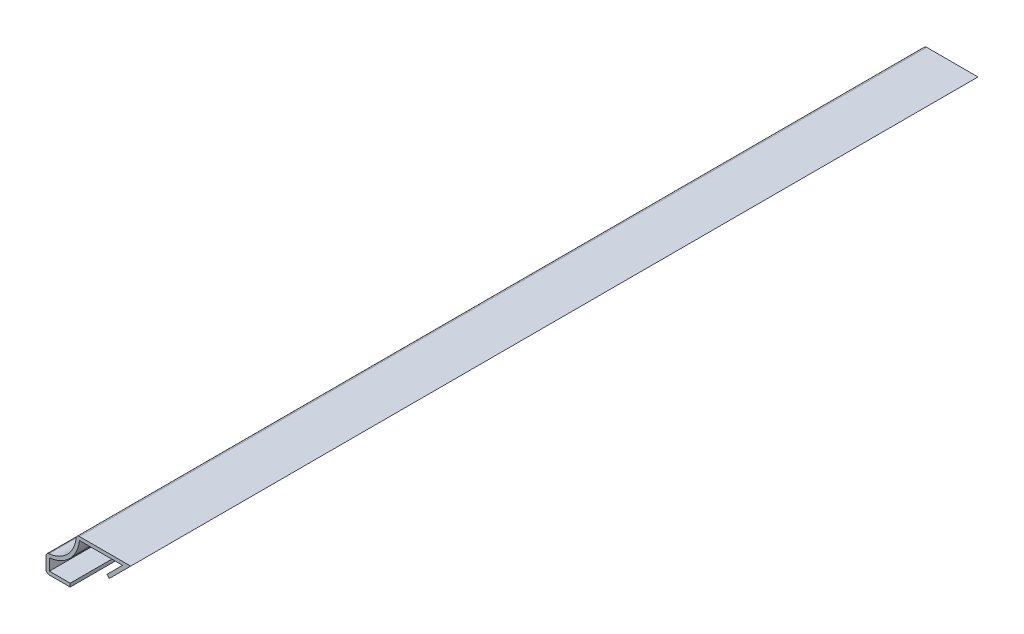
ISO-10303-21;
HEADER;
FILE_DESCRIPTION(('STEP AP214'),'2;1');
FILE_NAME('part.step','',(''),(''),'','','');
FILE_SCHEMA(('AUTOMOTIVE_DESIGN { 1 0 10303 214 1 1 1 1 }'));
ENDSEC;
DATA;
#1=APPLICATION_CONTEXT('core data for automotive mechanical design processes');
#2=APPLICATION_PROTOCOL_DEFINITION('international standard','automotive_design',2000,#1);
#3=PRODUCT_CONTEXT('',#1,'mechanical');
#4=PRODUCT('Part','Part','',(#3));
#5=PRODUCT_RELATED_PRODUCT_CATEGORY('part','',(#4));
#6=PRODUCT_DEFINITION_FORMATION('','',#4);
#7=PRODUCT_DEFINITION_CONTEXT('part definition',#1,'design');
#8=PRODUCT_DEFINITION('design','',#6,#7);
#9=PRODUCT_DEFINITION_SHAPE('','',#8);
#10=(LENGTH_UNIT() NAMED_UNIT(*) SI_UNIT(.MILLI.,.METRE.));
#11=(NAMED_UNIT(*) PLANE_ANGLE_UNIT() SI_UNIT($,.RADIAN.));
#12=(NAMED_UNIT(*) SI_UNIT($,.STERADIAN.) SOLID_ANGLE_UNIT());
#13=UNCERTAINTY_MEASURE_WITH_UNIT(LENGTH_MEASURE(1.E-05),#10,'distance_accuracy_value','');
#14=(GEOMETRIC_REPRESENTATION_CONTEXT(3) GLOBAL_UNCERTAINTY_ASSIGNED_CONTEXT((#13)) GLOBAL_UNIT_ASSIGNED_CONTEXT((#10,
#11,#12)) REPRESENTATION_CONTEXT('',''));
#15=CARTESIAN_POINT('',(0.,0.,0.));
#16=DIRECTION('',(0.,0.,1.));
#17=DIRECTION('',(1.,0.,0.));
#18=AXIS2_PLACEMENT_3D('',#15,#16,#17);
#19=CARTESIAN_POINT('',(15.2463820715252,13.3286179284748,-222.25));
#20=DIRECTION('',(-0.707106781186547,0.707106781186548,0.));
#21=DIRECTION('',(-0.707106781186548,-0.707106781186547,0.));
#22=AXIS2_PLACEMENT_3D('',#19,#20,#21);
#23=PLANE('',#22);
#24=DIRECTION('',(-0.707106781186548,-0.707106781186547,0.));
#25=VECTOR('',#24,1.);
#26=CARTESIAN_POINT('',(15.2463820715252,13.3286179284748,0.));
#27=LINE('',#26,#25);
#28=CARTESIAN_POINT('',(13.7287641430503,11.811,0.));
#29=VERTEX_POINT('',#28);
#30=CARTESIAN_POINT('',(9.63372199585694,7.71595785280662,0.));
#31=VERTEX_POINT('',#30);
#32=EDGE_CURVE('E196',#29,#31,#27,.T.);
#33=ORIENTED_EDGE('',*,*,#32,.F.);
#34=DIRECTION('',(0.,0.,1.));
#35=VECTOR('',#34,1.);
#36=CARTESIAN_POINT('',(13.7287641430503,11.811,-222.25));
#37=LINE('',#36,#35);
#38=CARTESIAN_POINT('',(13.7287641430503,11.811,-222.25));
#39=VERTEX_POINT('',#38);
#40=EDGE_CURVE('E168',#39,#29,#37,.T.);
#41=ORIENTED_EDGE('',*,*,#40,.F.);
#42=DIRECTION('',(-0.707106781186548,-0.707106781186547,0.));
#43=VECTOR('',#42,1.);
#44=CARTESIAN_POINT('',(15.2463820715252,13.3286179284748,-222.25));
#45=LINE('',#44,#43);
#46=CARTESIAN_POINT('',(9.63372199585694,7.71595785280662,-222.25));
#47=VERTEX_POINT('',#46);
#48=EDGE_CURVE('E149',#39,#47,#45,.T.);
#49=ORIENTED_EDGE('',*,*,#48,.T.);
#50=DIRECTION('',(0.,0.,1.));
#51=VECTOR('',#50,1.);
#52=CARTESIAN_POINT('',(9.63372199585694,7.71595785280662,-222.25));
#53=LINE('',#52,#51);
#54=EDGE_CURVE('E158',#47,#31,#53,.T.);
#55=ORIENTED_EDGE('',*,*,#54,.T.);
#56=EDGE_LOOP('',(#33,#41,#49,#55));
#57=FACE_BOUND('',#56,.T.);
#58=ADVANCED_FACE('F35',(#57),#23,.T.);
#59=CARTESIAN_POINT('',(1.5875,11.811,-222.25));
#60=DIRECTION('',(0.,-1.,0.));
#61=DIRECTION('',(0.,0.,-1.));
#62=AXIS2_PLACEMENT_3D('',#59,#60,#61);
#63=PLANE('',#62);
#64=DIRECTION('',(1.,0.,0.));
#65=VECTOR('',#64,1.);
#66=CARTESIAN_POINT('',(1.5875,11.811,0.));
#67=LINE('',#66,#65);
#68=CARTESIAN_POINT('',(2.43161609557148,11.811,0.));
#69=VERTEX_POINT('',#68);
#70=EDGE_CURVE('E169',#69,#29,#67,.T.);
#71=ORIENTED_EDGE('',*,*,#70,.F.);
#72=DIRECTION('',(0.,0.,1.));
#73=VECTOR('',#72,1.);
#74=CARTESIAN_POINT('',(2.43161609557148,11.811,-222.25));
#75=LINE('',#74,#73);
#76=CARTESIAN_POINT('',(2.43161609557148,11.811,-222.25));
#77=VERTEX_POINT('',#76);
#78=EDGE_CURVE('E223',#77,#69,#75,.T.);
#79=ORIENTED_EDGE('',*,*,#78,.F.);
#80=DIRECTION('',(1.,0.,0.));
#81=VECTOR('',#80,1.);
#82=CARTESIAN_POINT('',(1.5875,11.811,-222.25));
#83=LINE('',#82,#81);
#84=EDGE_CURVE('E166',#77,#39,#83,.T.);
#85=ORIENTED_EDGE('',*,*,#84,.T.);
#86=ORIENTED_EDGE('',*,*,#40,.T.);
#87=EDGE_LOOP('',(#71,#79,#85,#86));
#88=FACE_BOUND('',#87,.T.);
#89=ADVANCED_FACE('F296',(#88),#63,.T.);
#90=CARTESIAN_POINT('',(-6.35,12.7,-222.25));
#91=DIRECTION('',(0.,0.,1.));
#92=DIRECTION('',(1.,0.,0.));
#93=AXIS2_PLACEMENT_3D('',#90,#91,#92);
#94=CYLINDRICAL_SURFACE('',#93,8.8265);
#95=CARTESIAN_POINT('',(-6.35,12.7,0.));
#96=DIRECTION('',(0.,0.,1.));
#97=DIRECTION('',(1.,0.,0.));
#98=AXIS2_PLACEMENT_3D('',#95,#96,#97);
#99=CIRCLE('',#98,8.8265);
#100=CARTESIAN_POINT('',(-5.461,3.91838390442852,0.));
#101=VERTEX_POINT('',#100);
#102=EDGE_CURVE('E172',#101,#69,#99,.T.);
#103=ORIENTED_EDGE('',*,*,#102,.F.);
#104=DIRECTION('',(0.,0.,1.));
#105=VECTOR('',#104,1.);
#106=CARTESIAN_POINT('',(-5.461,3.91838390442852,-222.25));
#107=LINE('',#106,#105);
#108=CARTESIAN_POINT('',(-5.461,3.91838390442852,-222.25));
#109=VERTEX_POINT('',#108);
#110=EDGE_CURVE('E225',#109,#101,#107,.T.);
#111=ORIENTED_EDGE('',*,*,#110,.F.);
#112=CARTESIAN_POINT('',(-6.35,12.7,-222.25));
#113=DIRECTION('',(0.,0.,1.));
#114=DIRECTION('',(1.,0.,0.));
#115=AXIS2_PLACEMENT_3D('',#112,#113,#114);
#116=CIRCLE('',#115,8.8265);
#117=EDGE_CURVE('E192',#109,#77,#116,.T.);
#118=ORIENTED_EDGE('',*,*,#117,.T.);
#119=ORIENTED_EDGE('',*,*,#78,.T.);
#120=EDGE_LOOP('',(#103,#111,#118,#119));
#121=FACE_BOUND('',#120,.T.);
#122=ADVANCED_FACE('F315',(#121),#94,.T.);
#123=CARTESIAN_POINT('',(-5.461,0.,-222.25));
#124=DIRECTION('',(1.,0.,0.));
#125=DIRECTION('',(0.,0.,-1.));
#126=AXIS2_PLACEMENT_3D('',#123,#124,#125);
#127=PLANE('',#126);
#128=DIRECTION('',(0.,1.,0.));
#129=VECTOR('',#128,1.);
#130=CARTESIAN_POINT('',(-5.461,0.,0.));
#131=LINE('',#130,#129);
#132=CARTESIAN_POINT('',(-5.461,0.888999999999999,0.));
#133=VERTEX_POINT('',#132);
#134=EDGE_CURVE('E216',#133,#101,#131,.T.);
#135=ORIENTED_EDGE('',*,*,#134,.F.);
#136=DIRECTION('',(0.,0.,1.));
#137=VECTOR('',#136,1.);
#138=CARTESIAN_POINT('',(-5.461,0.888999999999999,-222.25));
#139=LINE('',#138,#137);
#140=CARTESIAN_POINT('',(-5.461,0.888999999999999,-222.25));
#141=VERTEX_POINT('',#140);
#142=EDGE_CURVE('E227',#141,#133,#139,.T.);
#143=ORIENTED_EDGE('',*,*,#142,.F.);
#144=DIRECTION('',(0.,1.,0.));
#145=VECTOR('',#144,1.);
#146=CARTESIAN_POINT('',(-5.461,0.,-222.25));
#147=LINE('',#146,#145);
#148=EDGE_CURVE('E189',#141,#109,#147,.T.);
#149=ORIENTED_EDGE('',*,*,#148,.T.);
#150=ORIENTED_EDGE('',*,*,#110,.T.);
#151=EDGE_LOOP('',(#135,#143,#149,#150));
#152=FACE_BOUND('',#151,.T.);
#153=ADVANCED_FACE('F291',(#152),#127,.T.);
#154=CARTESIAN_POINT('',(0.,0.889,-222.25));
#155=DIRECTION('',(0.,1.,0.));
#156=DIRECTION('',(-1.,0.,0.));
#157=AXIS2_PLACEMENT_3D('',#154,#155,#156);
#158=PLANE('',#157);
#159=DIRECTION('',(-1.,0.,0.));
#160=VECTOR('',#159,1.);
#161=CARTESIAN_POINT('',(0.,0.889,0.));
#162=LINE('',#161,#160);
#163=CARTESIAN_POINT('',(0.,0.889,0.));
#164=VERTEX_POINT('',#163);
#165=EDGE_CURVE('E213',#164,#133,#162,.T.);
#166=ORIENTED_EDGE('',*,*,#165,.F.);
#167=DIRECTION('',(0.,0.,1.));
#168=VECTOR('',#167,1.);
#169=CARTESIAN_POINT('',(0.,0.889,-222.25));
#170=LINE('',#169,#168);
#171=CARTESIAN_POINT('',(0.,0.889,-222.25));
#172=VERTEX_POINT('',#171);
#173=EDGE_CURVE('E229',#172,#164,#170,.T.);
#174=ORIENTED_EDGE('',*,*,#173,.F.);
#175=DIRECTION('',(-1.,0.,0.));
#176=VECTOR('',#175,1.);
#177=CARTESIAN_POINT('',(0.,0.889,-222.25));
#178=LINE('',#177,#176);
#179=EDGE_CURVE('E186',#172,#141,#178,.T.);
#180=ORIENTED_EDGE('',*,*,#179,.T.);
#181=ORIENTED_EDGE('',*,*,#142,.T.);
#182=EDGE_LOOP('',(#166,#174,#180,#181));
#183=FACE_BOUND('',#182,.T.);
#184=ADVANCED_FACE('F287',(#183),#158,.T.);
#185=CARTESIAN_POINT('',(0.,0.889,-222.25));
#186=DIRECTION('',(-1.,0.,0.));
#187=DIRECTION('',(0.,-1.,0.));
#188=AXIS2_PLACEMENT_3D('',#185,#186,#187);
#189=PLANE('',#188);
#190=DIRECTION('',(0.,-1.,0.));
#191=VECTOR('',#190,1.);
#192=CARTESIAN_POINT('',(0.,0.889,0.));
#193=LINE('',#192,#191);
#194=CARTESIAN_POINT('',(0.,0.,0.));
#195=VERTEX_POINT('',#194);
#196=EDGE_CURVE('E211',#164,#195,#193,.T.);
#197=ORIENTED_EDGE('',*,*,#196,.T.);
#198=DIRECTION('',(0.,0.,1.));
#199=VECTOR('',#198,1.);
#200=CARTESIAN_POINT('',(0.,0.,-222.25));
#201=LINE('',#200,#199);
#202=CARTESIAN_POINT('',(0.,0.,-222.25));
#203=VERTEX_POINT('',#202);
#204=EDGE_CURVE('E231',#203,#195,#201,.T.);
#205=ORIENTED_EDGE('',*,*,#204,.F.);
#206=DIRECTION('',(0.,-1.,0.));
#207=VECTOR('',#206,1.);
#208=CARTESIAN_POINT('',(0.,0.889,-222.25));
#209=LINE('',#208,#207);
#210=EDGE_CURVE('E184',#172,#203,#209,.T.);
#211=ORIENTED_EDGE('',*,*,#210,.F.);
#212=ORIENTED_EDGE('',*,*,#173,.T.);
#213=EDGE_LOOP('',(#197,#205,#211,#212));
#214=FACE_BOUND('',#213,.T.);
#215=ADVANCED_FACE('F283',(#214),#189,.F.);
#216=CARTESIAN_POINT('',(0.,0.,-222.25));
#217=DIRECTION('',(0.,1.,0.));
#218=DIRECTION('',(-1.,0.,0.));
#219=AXIS2_PLACEMENT_3D('',#216,#217,#218);
#220=PLANE('',#219);
#221=DIRECTION('',(-1.,0.,0.));
#222=VECTOR('',#221,1.);
#223=CARTESIAN_POINT('',(0.,0.,0.));
#224=LINE('',#223,#222);
#225=CARTESIAN_POINT('',(-5.461,0.,0.));
#226=VERTEX_POINT('',#225);
#227=EDGE_CURVE('E209',#195,#226,#224,.T.);
#228=ORIENTED_EDGE('',*,*,#227,.T.);
#229=DIRECTION('',(0.,0.,1.));
#230=VECTOR('',#229,1.);
#231=CARTESIAN_POINT('',(-5.461,0.,-222.25));
#232=LINE('',#231,#230);
#233=CARTESIAN_POINT('',(-5.461,0.,-222.25));
#234=VERTEX_POINT('',#233);
#235=EDGE_CURVE('E43',#226,#234,#232,.F.);
#236=ORIENTED_EDGE('',*,*,#235,.T.);
#237=DIRECTION('',(-1.,0.,0.));
#238=VECTOR('',#237,1.);
#239=CARTESIAN_POINT('',(0.,0.,-222.25));
#240=LINE('',#239,#238);
#241=EDGE_CURVE('E182',#203,#234,#240,.T.);
#242=ORIENTED_EDGE('',*,*,#241,.F.);
#243=ORIENTED_EDGE('',*,*,#204,.T.);
#244=EDGE_LOOP('',(#228,#236,#242,#243));
#245=FACE_BOUND('',#244,.T.);
#246=ADVANCED_FACE('F279',(#245),#220,.F.);
#247=CARTESIAN_POINT('',(-6.35,0.,-222.25));
#248=DIRECTION('',(1.,0.,0.));
#249=DIRECTION('',(0.,0.,-1.));
#250=AXIS2_PLACEMENT_3D('',#247,#248,#249);
#251=PLANE('',#250);
#252=DIRECTION('',(0.,1.,0.));
#253=VECTOR('',#252,1.);
#254=CARTESIAN_POINT('',(-6.35,0.,0.));
#255=LINE('',#254,#253);
#256=CARTESIAN_POINT('',(-6.35,0.888999999999999,0.));
#257=VERTEX_POINT('',#256);
#258=CARTESIAN_POINT('',(-6.35,3.91838390442852,0.));
#259=VERTEX_POINT('',#258);
#260=EDGE_CURVE('E206',#257,#259,#255,.T.);
#261=ORIENTED_EDGE('',*,*,#260,.T.);
#262=DIRECTION('',(0.,0.,1.));
#263=VECTOR('',#262,1.);
#264=CARTESIAN_POINT('',(-6.35,3.91838390442852,-222.25));
#265=LINE('',#264,#263);
#266=CARTESIAN_POINT('',(-6.35,3.91838390442852,-222.25));
#267=VERTEX_POINT('',#266);
#268=EDGE_CURVE('E251',#259,#267,#265,.F.);
#269=ORIENTED_EDGE('',*,*,#268,.T.);
#270=DIRECTION('',(0.,1.,0.));
#271=VECTOR('',#270,1.);
#272=CARTESIAN_POINT('',(-6.35,0.,-222.25));
#273=LINE('',#272,#271);
#274=CARTESIAN_POINT('',(-6.35,0.888999999999999,-222.25));
#275=VERTEX_POINT('',#274);
#276=EDGE_CURVE('E180',#275,#267,#273,.T.);
#277=ORIENTED_EDGE('',*,*,#276,.F.);
#278=DIRECTION('',(0.,0.,1.));
#279=VECTOR('',#278,1.);
#280=CARTESIAN_POINT('',(-6.35,0.888999999999999,-222.25));
#281=LINE('',#280,#279);
#282=EDGE_CURVE('E248',#275,#257,#281,.T.);
#283=ORIENTED_EDGE('',*,*,#282,.T.);
#284=EDGE_LOOP('',(#261,#269,#277,#283));
#285=FACE_BOUND('',#284,.T.);
#286=ADVANCED_FACE('F272',(#285),#251,.F.);
#287=CARTESIAN_POINT('',(-6.35,12.7,-222.25));
#288=DIRECTION('',(0.,0.,1.));
#289=DIRECTION('',(1.,0.,0.));
#290=AXIS2_PLACEMENT_3D('',#287,#288,#289);
#291=CYLINDRICAL_SURFACE('',#290,7.9375);
#292=CARTESIAN_POINT('',(-6.35,12.7,-222.25));
#293=DIRECTION('',(0.,0.,1.));
#294=DIRECTION('',(1.,0.,0.));
#295=AXIS2_PLACEMENT_3D('',#292,#293,#294);
#296=CIRCLE('',#295,7.9375);
#297=CARTESIAN_POINT('',(-5.55053956834532,4.80286322340695,-222.25));
#298=VERTEX_POINT('',#297);
#299=CARTESIAN_POINT('',(1.54713677659305,11.9005395683453,-222.25));
#300=VERTEX_POINT('',#299);
#301=EDGE_CURVE('E178',#298,#300,#296,.T.);
#302=ORIENTED_EDGE('',*,*,#301,.F.);
#303=DIRECTION('',(0.,0.,1.));
#304=VECTOR('',#303,1.);
#305=CARTESIAN_POINT('',(-5.55053956834532,4.80286322340695,-222.25));
#306=LINE('',#305,#304);
#307=CARTESIAN_POINT('',(-5.55053956834532,4.80286322340695,0.));
#308=VERTEX_POINT('',#307);
#309=EDGE_CURVE('E239',#298,#308,#306,.T.);
#310=ORIENTED_EDGE('',*,*,#309,.T.);
#311=CARTESIAN_POINT('',(-6.35,12.7,0.));
#312=DIRECTION('',(0.,0.,1.));
#313=DIRECTION('',(1.,0.,0.));
#314=AXIS2_PLACEMENT_3D('',#311,#312,#313);
#315=CIRCLE('',#314,7.9375);
#316=CARTESIAN_POINT('',(1.54713677659305,11.9005395683453,0.));
#317=VERTEX_POINT('',#316);
#318=EDGE_CURVE('E203',#308,#317,#315,.T.);
#319=ORIENTED_EDGE('',*,*,#318,.T.);
#320=DIRECTION('',(0.,0.,1.));
#321=VECTOR('',#320,1.);
#322=CARTESIAN_POINT('',(1.54713677659305,11.9005395683453,-222.25));
#323=LINE('',#322,#321);
#324=EDGE_CURVE('E222',#317,#300,#323,.F.);
#325=ORIENTED_EDGE('',*,*,#324,.T.);
#326=EDGE_LOOP('',(#302,#310,#319,#325));
#327=FACE_BOUND('',#326,.T.);
#328=ADVANCED_FACE('F264',(#327),#291,.F.);
#329=CARTESIAN_POINT('',(1.5875,12.7,-222.25));
#330=DIRECTION('',(0.,-1.,0.));
#331=DIRECTION('',(0.,0.,-1.));
#332=AXIS2_PLACEMENT_3D('',#329,#330,#331);
#333=PLANE('',#332);
#334=DIRECTION('',(1.,0.,0.));
#335=VECTOR('',#334,1.);
#336=CARTESIAN_POINT('',(1.5875,12.7,-222.25));
#337=LINE('',#336,#335);
#338=CARTESIAN_POINT('',(2.43161609557148,12.7,-222.25));
#339=VERTEX_POINT('',#338);
#340=CARTESIAN_POINT('',(15.875,12.7,-222.25));
#341=VERTEX_POINT('',#340);
#342=EDGE_CURVE('E176',#339,#341,#337,.T.);
#343=ORIENTED_EDGE('',*,*,#342,.F.);
#344=DIRECTION('',(0.,0.,1.));
#345=VECTOR('',#344,1.);
#346=CARTESIAN_POINT('',(2.43161609557148,12.7,-222.25));
#347=LINE('',#346,#345);
#348=CARTESIAN_POINT('',(2.43161609557148,12.7,0.));
#349=VERTEX_POINT('',#348);
#350=EDGE_CURVE('E11',#339,#349,#347,.T.);
#351=ORIENTED_EDGE('',*,*,#350,.T.);
#352=DIRECTION('',(1.,0.,0.));
#353=VECTOR('',#352,1.);
#354=CARTESIAN_POINT('',(1.5875,12.7,0.));
#355=LINE('',#354,#353);
#356=CARTESIAN_POINT('',(15.875,12.7,0.));
#357=VERTEX_POINT('',#356);
#358=EDGE_CURVE('E201',#349,#357,#355,.T.);
#359=ORIENTED_EDGE('',*,*,#358,.T.);
#360=DIRECTION('',(0.,0.,1.));
#361=VECTOR('',#360,1.);
#362=CARTESIAN_POINT('',(15.875,12.7,-222.25));
#363=LINE('',#362,#361);
#364=EDGE_CURVE('E234',#341,#357,#363,.T.);
#365=ORIENTED_EDGE('',*,*,#364,.F.);
#366=EDGE_LOOP('',(#343,#351,#359,#365));
#367=FACE_BOUND('',#366,.T.);
#368=ADVANCED_FACE('F303',(#367),#333,.F.);
#369=CARTESIAN_POINT('',(15.875,12.7,-222.25));
#370=DIRECTION('',(-0.707106781186547,0.707106781186548,0.));
#371=DIRECTION('',(-0.707106781186548,-0.707106781186547,0.));
#372=AXIS2_PLACEMENT_3D('',#369,#370,#371);
#373=PLANE('',#372);
#374=DIRECTION('',(-0.707106781186548,-0.707106781186547,0.));
#375=VECTOR('',#374,1.);
#376=CARTESIAN_POINT('',(15.875,12.7,0.));
#377=LINE('',#376,#375);
#378=CARTESIAN_POINT('',(10.2623399243318,7.08733992433178,0.));
#379=VERTEX_POINT('',#378);
#380=EDGE_CURVE('E199',#357,#379,#377,.T.);
#381=ORIENTED_EDGE('',*,*,#380,.T.);
#382=DIRECTION('',(0.,0.,1.));
#383=VECTOR('',#382,1.);
#384=CARTESIAN_POINT('',(10.2623399243318,7.08733992433178,-222.25));
#385=LINE('',#384,#383);
#386=CARTESIAN_POINT('',(10.2623399243318,7.08733992433178,-222.25));
#387=VERTEX_POINT('',#386);
#388=EDGE_CURVE('E165',#387,#379,#385,.T.);
#389=ORIENTED_EDGE('',*,*,#388,.F.);
#390=DIRECTION('',(-0.707106781186548,-0.707106781186547,0.));
#391=VECTOR('',#390,1.);
#392=CARTESIAN_POINT('',(15.875,12.7,-222.25));
#393=LINE('',#392,#391);
#394=EDGE_CURVE('E152',#341,#387,#393,.T.);
#395=ORIENTED_EDGE('',*,*,#394,.F.);
#396=ORIENTED_EDGE('',*,*,#364,.T.);
#397=EDGE_LOOP('',(#381,#389,#395,#396));
#398=FACE_BOUND('',#397,.T.);
#399=ADVANCED_FACE('F300',(#398),#373,.F.);
#400=CARTESIAN_POINT('',(10.2623399243318,7.08733992433178,-222.25));
#401=DIRECTION('',(0.707106781186548,0.707106781186548,0.));
#402=DIRECTION('',(-0.707106781186548,0.707106781186548,0.));
#403=AXIS2_PLACEMENT_3D('',#400,#401,#402);
#404=PLANE('',#403);
#405=DIRECTION('',(-0.707106781186548,0.707106781186548,0.));
#406=VECTOR('',#405,1.);
#407=CARTESIAN_POINT('',(10.2623399243318,7.08733992433178,0.));
#408=LINE('',#407,#406);
#409=EDGE_CURVE('E161',#379,#31,#408,.T.);
#410=ORIENTED_EDGE('',*,*,#409,.T.);
#411=ORIENTED_EDGE('',*,*,#54,.F.);
#412=DIRECTION('',(-0.707106781186548,0.707106781186548,0.));
#413=VECTOR('',#412,1.);
#414=CARTESIAN_POINT('',(10.2623399243318,7.08733992433178,-222.25));
#415=LINE('',#414,#413);
#416=EDGE_CURVE('E143',#387,#47,#415,.T.);
#417=ORIENTED_EDGE('',*,*,#416,.F.);
#418=ORIENTED_EDGE('',*,*,#388,.T.);
#419=EDGE_LOOP('',(#410,#411,#417,#418));
#420=FACE_BOUND('',#419,.T.);
#421=ADVANCED_FACE('F159',(#420),#404,.F.);
#422=CARTESIAN_POINT('',(-6.35,12.7,-222.25));
#423=DIRECTION('',(0.,0.,1.));
#424=DIRECTION('',(1.,0.,0.));
#425=AXIS2_PLACEMENT_3D('',#422,#423,#424);
#426=PLANE('',#425);
#427=ORIENTED_EDGE('',*,*,#276,.T.);
#428=CARTESIAN_POINT('',(-5.461,3.91838390442852,-222.25));
#429=DIRECTION('',(0.,0.,1.));
#430=DIRECTION('',(1.,0.,0.));
#431=AXIS2_PLACEMENT_3D('',#428,#429,#430);
#432=CIRCLE('',#431,0.889);
#433=EDGE_CURVE('E256',#267,#298,#432,.F.);
#434=ORIENTED_EDGE('',*,*,#433,.T.);
#435=ORIENTED_EDGE('',*,*,#301,.T.);
#436=CARTESIAN_POINT('',(2.43161609557148,11.811,-222.25));
#437=DIRECTION('',(0.,0.,1.));
#438=DIRECTION('',(1.,0.,0.));
#439=AXIS2_PLACEMENT_3D('',#436,#437,#438);
#440=CIRCLE('',#439,0.889);
#441=EDGE_CURVE('E50',#300,#339,#440,.F.);
#442=ORIENTED_EDGE('',*,*,#441,.T.);
#443=ORIENTED_EDGE('',*,*,#342,.T.);
#444=ORIENTED_EDGE('',*,*,#394,.T.);
#445=ORIENTED_EDGE('',*,*,#416,.T.);
#446=ORIENTED_EDGE('',*,*,#48,.F.);
#447=ORIENTED_EDGE('',*,*,#84,.F.);
#448=ORIENTED_EDGE('',*,*,#117,.F.);
#449=ORIENTED_EDGE('',*,*,#148,.F.);
#450=ORIENTED_EDGE('',*,*,#179,.F.);
#451=ORIENTED_EDGE('',*,*,#210,.T.);
#452=ORIENTED_EDGE('',*,*,#241,.T.);
#453=CARTESIAN_POINT('',(-5.461,0.888999999999999,-222.25));
#454=DIRECTION('',(0.,0.,1.));
#455=DIRECTION('',(1.,0.,0.));
#456=AXIS2_PLACEMENT_3D('',#453,#454,#455);
#457=CIRCLE('',#456,0.889);
#458=EDGE_CURVE('E254',#234,#275,#457,.F.);
#459=ORIENTED_EDGE('',*,*,#458,.T.);
#460=EDGE_LOOP('',(#427,#434,#435,#442,#443,#444,#445,#446,#447,#448,#449,#450,#451,#452,#459));
#461=FACE_BOUND('',#460,.T.);
#462=ADVANCED_FACE('F146',(#461),#426,.F.);
#463=CARTESIAN_POINT('',(-6.35,12.7,0.));
#464=DIRECTION('',(0.,0.,1.));
#465=DIRECTION('',(1.,0.,0.));
#466=AXIS2_PLACEMENT_3D('',#463,#464,#465);
#467=PLANE('',#466);
#468=ORIENTED_EDGE('',*,*,#318,.F.);
#469=CARTESIAN_POINT('',(-5.461,3.91838390442852,0.));
#470=DIRECTION('',(0.,0.,1.));
#471=DIRECTION('',(1.,0.,0.));
#472=AXIS2_PLACEMENT_3D('',#469,#470,#471);
#473=CIRCLE('',#472,0.889);
#474=EDGE_CURVE('E246',#308,#259,#473,.T.);
#475=ORIENTED_EDGE('',*,*,#474,.T.);
#476=ORIENTED_EDGE('',*,*,#260,.F.);
#477=CARTESIAN_POINT('',(-5.461,0.888999999999999,0.));
#478=DIRECTION('',(0.,0.,1.));
#479=DIRECTION('',(1.,0.,0.));
#480=AXIS2_PLACEMENT_3D('',#477,#478,#479);
#481=CIRCLE('',#480,0.889);
#482=EDGE_CURVE('E244',#257,#226,#481,.T.);
#483=ORIENTED_EDGE('',*,*,#482,.T.);
#484=ORIENTED_EDGE('',*,*,#227,.F.);
#485=ORIENTED_EDGE('',*,*,#196,.F.);
#486=ORIENTED_EDGE('',*,*,#165,.T.);
#487=ORIENTED_EDGE('',*,*,#134,.T.);
#488=ORIENTED_EDGE('',*,*,#102,.T.);
#489=ORIENTED_EDGE('',*,*,#70,.T.);
#490=ORIENTED_EDGE('',*,*,#32,.T.);
#491=ORIENTED_EDGE('',*,*,#409,.F.);
#492=ORIENTED_EDGE('',*,*,#380,.F.);
#493=ORIENTED_EDGE('',*,*,#358,.F.);
#494=CARTESIAN_POINT('',(2.43161609557148,11.811,0.));
#495=DIRECTION('',(0.,0.,1.));
#496=DIRECTION('',(1.,0.,0.));
#497=AXIS2_PLACEMENT_3D('',#494,#495,#496);
#498=CIRCLE('',#497,0.889);
#499=EDGE_CURVE('E242',#349,#317,#498,.T.);
#500=ORIENTED_EDGE('',*,*,#499,.T.);
#501=EDGE_LOOP('',(#468,#475,#476,#483,#484,#485,#486,#487,#488,#489,#490,#491,#492,#493,#500));
#502=FACE_BOUND('',#501,.T.);
#503=ADVANCED_FACE('F270',(#502),#467,.T.);
#504=CARTESIAN_POINT('',(-5.461,3.91838390442852,-222.25));
#505=DIRECTION('',(0.,0.,1.));
#506=DIRECTION('',(1.,0.,0.));
#507=AXIS2_PLACEMENT_3D('',#504,#505,#506);
#508=CYLINDRICAL_SURFACE('',#507,0.889);
#509=ORIENTED_EDGE('',*,*,#433,.F.);
#510=ORIENTED_EDGE('',*,*,#268,.F.);
#511=ORIENTED_EDGE('',*,*,#474,.F.);
#512=ORIENTED_EDGE('',*,*,#309,.F.);
#513=EDGE_LOOP('',(#509,#510,#511,#512));
#514=FACE_BOUND('',#513,.T.);
#515=ADVANCED_FACE('F267',(#514),#508,.T.);
#516=CARTESIAN_POINT('',(-5.461,0.888999999999999,-222.25));
#517=DIRECTION('',(0.,0.,1.));
#518=DIRECTION('',(1.,0.,0.));
#519=AXIS2_PLACEMENT_3D('',#516,#517,#518);
#520=CYLINDRICAL_SURFACE('',#519,0.889);
#521=ORIENTED_EDGE('',*,*,#458,.F.);
#522=ORIENTED_EDGE('',*,*,#235,.F.);
#523=ORIENTED_EDGE('',*,*,#482,.F.);
#524=ORIENTED_EDGE('',*,*,#282,.F.);
#525=EDGE_LOOP('',(#521,#522,#523,#524));
#526=FACE_BOUND('',#525,.T.);
#527=ADVANCED_FACE('F276',(#526),#520,.T.);
#528=CARTESIAN_POINT('',(2.43161609557148,11.811,-222.25));
#529=DIRECTION('',(0.,0.,1.));
#530=DIRECTION('',(1.,0.,0.));
#531=AXIS2_PLACEMENT_3D('',#528,#529,#530);
#532=CYLINDRICAL_SURFACE('',#531,0.889);
#533=ORIENTED_EDGE('',*,*,#441,.F.);
#534=ORIENTED_EDGE('',*,*,#324,.F.);
#535=ORIENTED_EDGE('',*,*,#499,.F.);
#536=ORIENTED_EDGE('',*,*,#350,.F.);
#537=EDGE_LOOP('',(#533,#534,#535,#536));
#538=FACE_BOUND('',#537,.T.);
#539=ADVANCED_FACE('F37',(#538),#532,.T.);
#540=CLOSED_SHELL('',(#58,#89,#122,#153,#184,#215,#246,#286,#328,#368,#399,#421,#462,#503,#515,
#527,#539));
#541=MANIFOLD_SOLID_BREP('B2',#540);
#542=ADVANCED_BREP_SHAPE_REPRESENTATION('',(#18,#541),#14);
#543=SHAPE_DEFINITION_REPRESENTATION(#9,#542);
ENDSEC;
END-ISO-10303-21;
